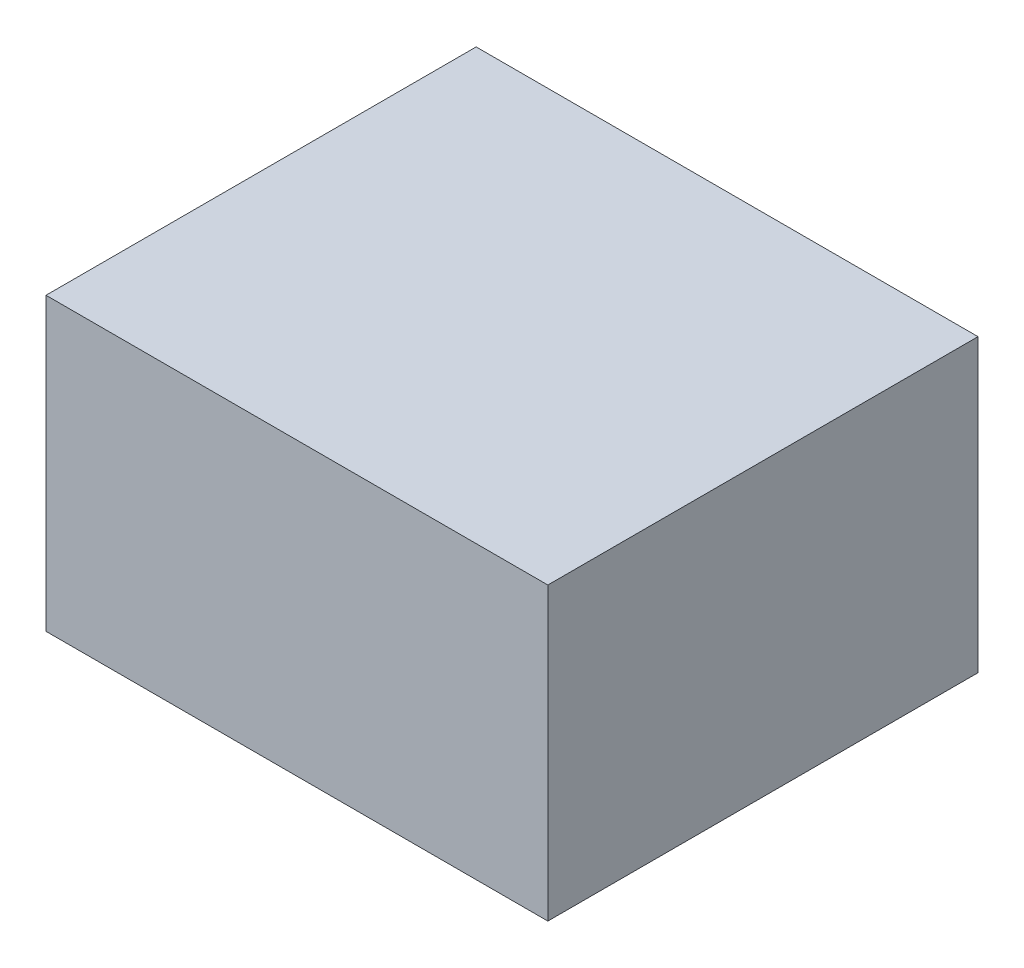
ISO-10303-21;
HEADER;
FILE_DESCRIPTION(('STEP AP214'),'2;1');
FILE_NAME('part.step','',(''),(''),'','','');
FILE_SCHEMA(('AUTOMOTIVE_DESIGN { 1 0 10303 214 1 1 1 1 }'));
ENDSEC;
DATA;
#1=APPLICATION_CONTEXT('core data for automotive mechanical design processes');
#2=APPLICATION_PROTOCOL_DEFINITION('international standard','automotive_design',2000,#1);
#3=PRODUCT_CONTEXT('',#1,'mechanical');
#4=PRODUCT('Part','Part','',(#3));
#5=PRODUCT_RELATED_PRODUCT_CATEGORY('part','',(#4));
#6=PRODUCT_DEFINITION_FORMATION('','',#4);
#7=PRODUCT_DEFINITION_CONTEXT('part definition',#1,'design');
#8=PRODUCT_DEFINITION('design','',#6,#7);
#9=PRODUCT_DEFINITION_SHAPE('','',#8);
#10=(LENGTH_UNIT() NAMED_UNIT(*) SI_UNIT(.MILLI.,.METRE.));
#11=(NAMED_UNIT(*) PLANE_ANGLE_UNIT() SI_UNIT($,.RADIAN.));
#12=(NAMED_UNIT(*) SI_UNIT($,.STERADIAN.) SOLID_ANGLE_UNIT());
#13=UNCERTAINTY_MEASURE_WITH_UNIT(LENGTH_MEASURE(1.E-05),#10,'distance_accuracy_value','');
#14=(GEOMETRIC_REPRESENTATION_CONTEXT(3) GLOBAL_UNCERTAINTY_ASSIGNED_CONTEXT((#13)) GLOBAL_UNIT_ASSIGNED_CONTEXT((#10,
#11,#12)) REPRESENTATION_CONTEXT('',''));
#15=CARTESIAN_POINT('',(0.,0.,0.));
#16=DIRECTION('',(0.,0.,1.));
#17=DIRECTION('',(1.,0.,0.));
#18=AXIS2_PLACEMENT_3D('',#15,#16,#17);
#19=CARTESIAN_POINT('',(0.500000000000029,0.475,0.725000000000036));
#20=DIRECTION('',(1.,0.,0.));
#21=DIRECTION('',(0.,0.,-1.));
#22=AXIS2_PLACEMENT_3D('',#19,#20,#21);
#23=PLANE('',#22);
#24=DIRECTION('',(0.,0.,1.));
#25=VECTOR('',#24,1.);
#26=CARTESIAN_POINT('',(0.500000000000029,0.272,0.725000000000036));
#27=LINE('',#26,#25);
#28=CARTESIAN_POINT('',(0.500000000000029,0.272,0.725000000000036));
#29=VERTEX_POINT('',#28);
#30=CARTESIAN_POINT('',(0.500000000000016,0.272,1.025));
#31=VERTEX_POINT('',#30);
#32=EDGE_CURVE('E11',#29,#31,#27,.T.);
#33=ORIENTED_EDGE('',*,*,#32,.T.);
#34=DIRECTION('',(0.,-1.,0.));
#35=VECTOR('',#34,1.);
#36=CARTESIAN_POINT('',(0.500000000000016,0.475,1.025));
#37=LINE('',#36,#35);
#38=CARTESIAN_POINT('',(0.500000000000016,0.475,1.025));
#39=VERTEX_POINT('',#38);
#40=EDGE_CURVE('E24',#39,#31,#37,.T.);
#41=ORIENTED_EDGE('',*,*,#40,.F.);
#42=DIRECTION('',(0.,0.,1.));
#43=VECTOR('',#42,1.);
#44=CARTESIAN_POINT('',(0.500000000000029,0.475,0.725000000000036));
#45=LINE('',#44,#43);
#46=CARTESIAN_POINT('',(0.500000000000029,0.475,0.725000000000036));
#47=VERTEX_POINT('',#46);
#48=EDGE_CURVE('E88',#47,#39,#45,.T.);
#49=ORIENTED_EDGE('',*,*,#48,.F.);
#50=DIRECTION('',(0.,-1.,0.));
#51=VECTOR('',#50,1.);
#52=CARTESIAN_POINT('',(0.500000000000029,0.475,0.725000000000036));
#53=LINE('',#52,#51);
#54=EDGE_CURVE('E77',#47,#29,#53,.T.);
#55=ORIENTED_EDGE('',*,*,#54,.T.);
#56=EDGE_LOOP('',(#33,#41,#49,#55));
#57=FACE_BOUND('',#56,.T.);
#58=ADVANCED_FACE('F17',(#57),#23,.F.);
#59=CARTESIAN_POINT('',(0.500000000000016,0.475,1.025));
#60=DIRECTION('',(0.,0.,-1.));
#61=DIRECTION('',(-1.,0.,0.));
#62=AXIS2_PLACEMENT_3D('',#59,#60,#61);
#63=PLANE('',#62);
#64=DIRECTION('',(1.,0.,0.));
#65=VECTOR('',#64,1.);
#66=CARTESIAN_POINT('',(0.500000000000016,0.272,1.025));
#67=LINE('',#66,#65);
#68=CARTESIAN_POINT('',(0.850000000000016,0.272,1.025));
#69=VERTEX_POINT('',#68);
#70=EDGE_CURVE('E85',#31,#69,#67,.T.);
#71=ORIENTED_EDGE('',*,*,#70,.T.);
#72=DIRECTION('',(0.,-1.,0.));
#73=VECTOR('',#72,1.);
#74=CARTESIAN_POINT('',(0.850000000000016,0.475,1.025));
#75=LINE('',#74,#73);
#76=CARTESIAN_POINT('',(0.850000000000016,0.475,1.025));
#77=VERTEX_POINT('',#76);
#78=EDGE_CURVE('E83',#77,#69,#75,.T.);
#79=ORIENTED_EDGE('',*,*,#78,.F.);
#80=DIRECTION('',(1.,0.,0.));
#81=VECTOR('',#80,1.);
#82=CARTESIAN_POINT('',(0.500000000000016,0.475,1.025));
#83=LINE('',#82,#81);
#84=EDGE_CURVE('E72',#39,#77,#83,.T.);
#85=ORIENTED_EDGE('',*,*,#84,.F.);
#86=ORIENTED_EDGE('',*,*,#40,.T.);
#87=EDGE_LOOP('',(#71,#79,#85,#86));
#88=FACE_BOUND('',#87,.T.);
#89=ADVANCED_FACE('F90',(#88),#63,.F.);
#90=CARTESIAN_POINT('',(0.850000000000016,0.475,1.025));
#91=DIRECTION('',(-1.,0.,0.));
#92=DIRECTION('',(0.,0.,1.));
#93=AXIS2_PLACEMENT_3D('',#90,#91,#92);
#94=PLANE('',#93);
#95=DIRECTION('',(0.,0.,-1.));
#96=VECTOR('',#95,1.);
#97=CARTESIAN_POINT('',(0.850000000000016,0.272,1.025));
#98=LINE('',#97,#96);
#99=CARTESIAN_POINT('',(0.85000000000003,0.272,0.725000000000051));
#100=VERTEX_POINT('',#99);
#101=EDGE_CURVE('E60',#69,#100,#98,.T.);
#102=ORIENTED_EDGE('',*,*,#101,.T.);
#103=DIRECTION('',(0.,-1.,0.));
#104=VECTOR('',#103,1.);
#105=CARTESIAN_POINT('',(0.85000000000003,0.475,0.725000000000051));
#106=LINE('',#105,#104);
#107=CARTESIAN_POINT('',(0.85000000000003,0.475,0.725000000000051));
#108=VERTEX_POINT('',#107);
#109=EDGE_CURVE('E54',#108,#100,#106,.T.);
#110=ORIENTED_EDGE('',*,*,#109,.F.);
#111=DIRECTION('',(0.,0.,-1.));
#112=VECTOR('',#111,1.);
#113=CARTESIAN_POINT('',(0.850000000000016,0.475,1.025));
#114=LINE('',#113,#112);
#115=EDGE_CURVE('E58',#77,#108,#114,.T.);
#116=ORIENTED_EDGE('',*,*,#115,.F.);
#117=ORIENTED_EDGE('',*,*,#78,.T.);
#118=EDGE_LOOP('',(#102,#110,#116,#117));
#119=FACE_BOUND('',#118,.T.);
#120=ADVANCED_FACE('F56',(#119),#94,.F.);
#121=CARTESIAN_POINT('',(0.85000000000003,0.475,0.725000000000052));
#122=DIRECTION('',(0.,0.,1.));
#123=DIRECTION('',(1.,0.,0.));
#124=AXIS2_PLACEMENT_3D('',#121,#122,#123);
#125=PLANE('',#124);
#126=DIRECTION('',(-1.,0.,0.));
#127=VECTOR('',#126,1.);
#128=CARTESIAN_POINT('',(0.85000000000003,0.272,0.725000000000051));
#129=LINE('',#128,#127);
#130=EDGE_CURVE('E73',#100,#29,#129,.T.);
#131=ORIENTED_EDGE('',*,*,#130,.T.);
#132=ORIENTED_EDGE('',*,*,#54,.F.);
#133=DIRECTION('',(-1.,0.,0.));
#134=VECTOR('',#133,1.);
#135=CARTESIAN_POINT('',(0.85000000000003,0.475,0.725000000000051));
#136=LINE('',#135,#134);
#137=EDGE_CURVE('E70',#108,#47,#136,.T.);
#138=ORIENTED_EDGE('',*,*,#137,.F.);
#139=ORIENTED_EDGE('',*,*,#109,.T.);
#140=EDGE_LOOP('',(#131,#132,#138,#139));
#141=FACE_BOUND('',#140,.T.);
#142=ADVANCED_FACE('F76',(#141),#125,.F.);
#143=CARTESIAN_POINT('',(0.,0.475,0.));
#144=DIRECTION('',(0.,1.,0.));
#145=DIRECTION('',(0.,0.,1.));
#146=AXIS2_PLACEMENT_3D('',#143,#144,#145);
#147=PLANE('',#146);
#148=ORIENTED_EDGE('',*,*,#48,.T.);
#149=ORIENTED_EDGE('',*,*,#84,.T.);
#150=ORIENTED_EDGE('',*,*,#115,.T.);
#151=ORIENTED_EDGE('',*,*,#137,.T.);
#152=EDGE_LOOP('',(#148,#149,#150,#151));
#153=FACE_BOUND('',#152,.T.);
#154=ADVANCED_FACE('F69',(#153),#147,.T.);
#155=CARTESIAN_POINT('',(0.,0.272,0.));
#156=DIRECTION('',(0.,1.,0.));
#157=DIRECTION('',(0.,0.,1.));
#158=AXIS2_PLACEMENT_3D('',#155,#156,#157);
#159=PLANE('',#158);
#160=ORIENTED_EDGE('',*,*,#32,.F.);
#161=ORIENTED_EDGE('',*,*,#130,.F.);
#162=ORIENTED_EDGE('',*,*,#101,.F.);
#163=ORIENTED_EDGE('',*,*,#70,.F.);
#164=EDGE_LOOP('',(#160,#161,#162,#163));
#165=FACE_BOUND('',#164,.T.);
#166=ADVANCED_FACE('F91',(#165),#159,.F.);
#167=CLOSED_SHELL('',(#58,#89,#120,#142,#154,#166));
#168=MANIFOLD_SOLID_BREP('B1',#167);
#169=ADVANCED_BREP_SHAPE_REPRESENTATION('',(#18,#168),#14);
#170=SHAPE_DEFINITION_REPRESENTATION(#9,#169);
ENDSEC;
END-ISO-10303-21;
